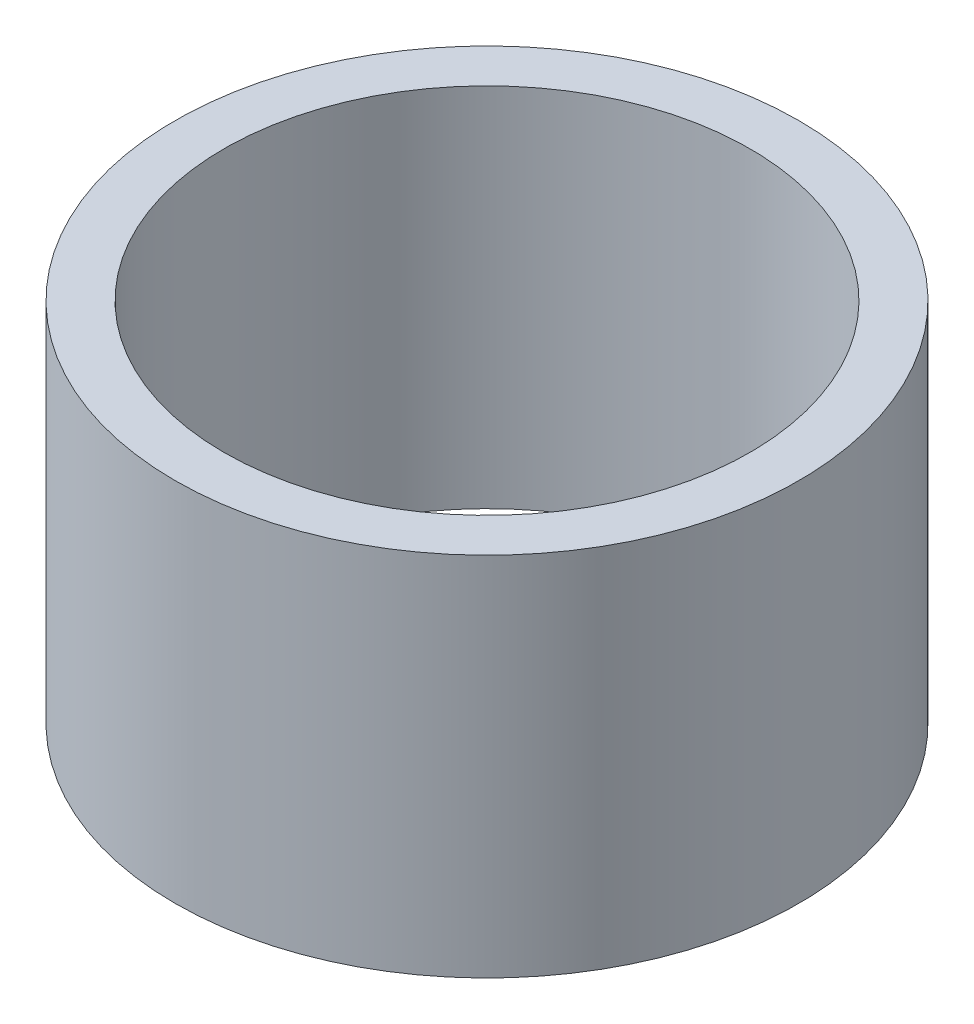
ISO-10303-21;
HEADER;
FILE_DESCRIPTION(('STEP AP214'),'2;1');
FILE_NAME('part.step','',(''),(''),'','','');
FILE_SCHEMA(('AUTOMOTIVE_DESIGN { 1 0 10303 214 1 1 1 1 }'));
ENDSEC;
DATA;
#1=APPLICATION_CONTEXT('core data for automotive mechanical design processes');
#2=APPLICATION_PROTOCOL_DEFINITION('international standard','automotive_design',2000,#1);
#3=PRODUCT_CONTEXT('',#1,'mechanical');
#4=PRODUCT('Part','Part','',(#3));
#5=PRODUCT_RELATED_PRODUCT_CATEGORY('part','',(#4));
#6=PRODUCT_DEFINITION_FORMATION('','',#4);
#7=PRODUCT_DEFINITION_CONTEXT('part definition',#1,'design');
#8=PRODUCT_DEFINITION('design','',#6,#7);
#9=PRODUCT_DEFINITION_SHAPE('','',#8);
#10=(LENGTH_UNIT() NAMED_UNIT(*) SI_UNIT(.MILLI.,.METRE.));
#11=(NAMED_UNIT(*) PLANE_ANGLE_UNIT() SI_UNIT($,.RADIAN.));
#12=(NAMED_UNIT(*) SI_UNIT($,.STERADIAN.) SOLID_ANGLE_UNIT());
#13=UNCERTAINTY_MEASURE_WITH_UNIT(LENGTH_MEASURE(1.E-05),#10,'distance_accuracy_value','');
#14=(GEOMETRIC_REPRESENTATION_CONTEXT(3) GLOBAL_UNCERTAINTY_ASSIGNED_CONTEXT((#13)) GLOBAL_UNIT_ASSIGNED_CONTEXT((#10,
#11,#12)) REPRESENTATION_CONTEXT('',''));
#15=CARTESIAN_POINT('',(0.,0.,0.));
#16=DIRECTION('',(0.,0.,1.));
#17=DIRECTION('',(1.,0.,0.));
#18=AXIS2_PLACEMENT_3D('',#15,#16,#17);
#19=CARTESIAN_POINT('',(0.,38.1,0.));
#20=DIRECTION('',(0.,1.,0.));
#21=DIRECTION('',(0.,0.,1.));
#22=AXIS2_PLACEMENT_3D('',#19,#20,#21);
#23=PLANE('',#22);
#24=CARTESIAN_POINT('',(0.,38.1,0.));
#25=DIRECTION('',(0.,1.,0.));
#26=DIRECTION('',(0.,0.,1.));
#27=AXIS2_PLACEMENT_3D('',#24,#25,#26);
#28=CIRCLE('',#27,32.4485);
#29=CARTESIAN_POINT('',(0.,38.1,32.4485));
#30=VERTEX_POINT('',#29);
#31=EDGE_CURVE('E10',#30,#30,#28,.T.);
#32=ORIENTED_EDGE('',*,*,#31,.T.);
#33=EDGE_LOOP('',(#32));
#34=FACE_BOUND('',#33,.T.);
#35=CARTESIAN_POINT('',(0.,38.1,0.));
#36=DIRECTION('',(0.,1.,0.));
#37=DIRECTION('',(0.,0.,1.));
#38=AXIS2_PLACEMENT_3D('',#35,#36,#37);
#39=CIRCLE('',#38,27.3685);
#40=CARTESIAN_POINT('',(0.,38.1,27.3685));
#41=VERTEX_POINT('',#40);
#42=EDGE_CURVE('E48',#41,#41,#39,.T.);
#43=ORIENTED_EDGE('',*,*,#42,.F.);
#44=EDGE_LOOP('',(#43));
#45=FACE_BOUND('',#44,.T.);
#46=ADVANCED_FACE('F37',(#34,#45),#23,.T.);
#47=CARTESIAN_POINT('',(0.,0.,0.));
#48=DIRECTION('',(0.,1.,0.));
#49=DIRECTION('',(0.,0.,1.));
#50=AXIS2_PLACEMENT_3D('',#47,#48,#49);
#51=PLANE('',#50);
#52=CARTESIAN_POINT('',(0.,0.,0.));
#53=DIRECTION('',(0.,1.,0.));
#54=DIRECTION('',(0.,0.,1.));
#55=AXIS2_PLACEMENT_3D('',#52,#53,#54);
#56=CIRCLE('',#55,32.4485);
#57=CARTESIAN_POINT('',(0.,0.,32.4485));
#58=VERTEX_POINT('',#57);
#59=EDGE_CURVE('E41',#58,#58,#56,.T.);
#60=ORIENTED_EDGE('',*,*,#59,.F.);
#61=EDGE_LOOP('',(#60));
#62=FACE_BOUND('',#61,.T.);
#63=CARTESIAN_POINT('',(0.,0.,0.));
#64=DIRECTION('',(0.,1.,0.));
#65=DIRECTION('',(0.,0.,1.));
#66=AXIS2_PLACEMENT_3D('',#63,#64,#65);
#67=CIRCLE('',#66,27.3685);
#68=CARTESIAN_POINT('',(0.,0.,27.3685));
#69=VERTEX_POINT('',#68);
#70=EDGE_CURVE('E50',#69,#69,#67,.T.);
#71=ORIENTED_EDGE('',*,*,#70,.T.);
#72=EDGE_LOOP('',(#71));
#73=FACE_BOUND('',#72,.T.);
#74=ADVANCED_FACE('F60',(#62,#73),#51,.F.);
#75=CARTESIAN_POINT('',(0.,38.1,0.));
#76=DIRECTION('',(0.,-1.,0.));
#77=DIRECTION('',(0.,0.,-1.));
#78=AXIS2_PLACEMENT_3D('',#75,#76,#77);
#79=CYLINDRICAL_SURFACE('',#78,32.4485);
#80=ORIENTED_EDGE('',*,*,#31,.F.);
#81=EDGE_LOOP('',(#80));
#82=FACE_BOUND('',#81,.T.);
#83=ORIENTED_EDGE('',*,*,#59,.T.);
#84=EDGE_LOOP('',(#83));
#85=FACE_BOUND('',#84,.T.);
#86=ADVANCED_FACE('F39',(#82,#85),#79,.T.);
#87=CARTESIAN_POINT('',(0.,38.1,0.));
#88=DIRECTION('',(0.,-1.,0.));
#89=DIRECTION('',(0.,0.,-1.));
#90=AXIS2_PLACEMENT_3D('',#87,#88,#89);
#91=CYLINDRICAL_SURFACE('',#90,27.3685);
#92=ORIENTED_EDGE('',*,*,#42,.T.);
#93=EDGE_LOOP('',(#92));
#94=FACE_BOUND('',#93,.T.);
#95=ORIENTED_EDGE('',*,*,#70,.F.);
#96=EDGE_LOOP('',(#95));
#97=FACE_BOUND('',#96,.T.);
#98=ADVANCED_FACE('F56',(#94,#97),#91,.F.);
#99=CLOSED_SHELL('',(#46,#74,#86,#98));
#100=MANIFOLD_SOLID_BREP('B2',#99);
#101=ADVANCED_BREP_SHAPE_REPRESENTATION('',(#18,#100),#14);
#102=SHAPE_DEFINITION_REPRESENTATION(#9,#101);
ENDSEC;
END-ISO-10303-21;
